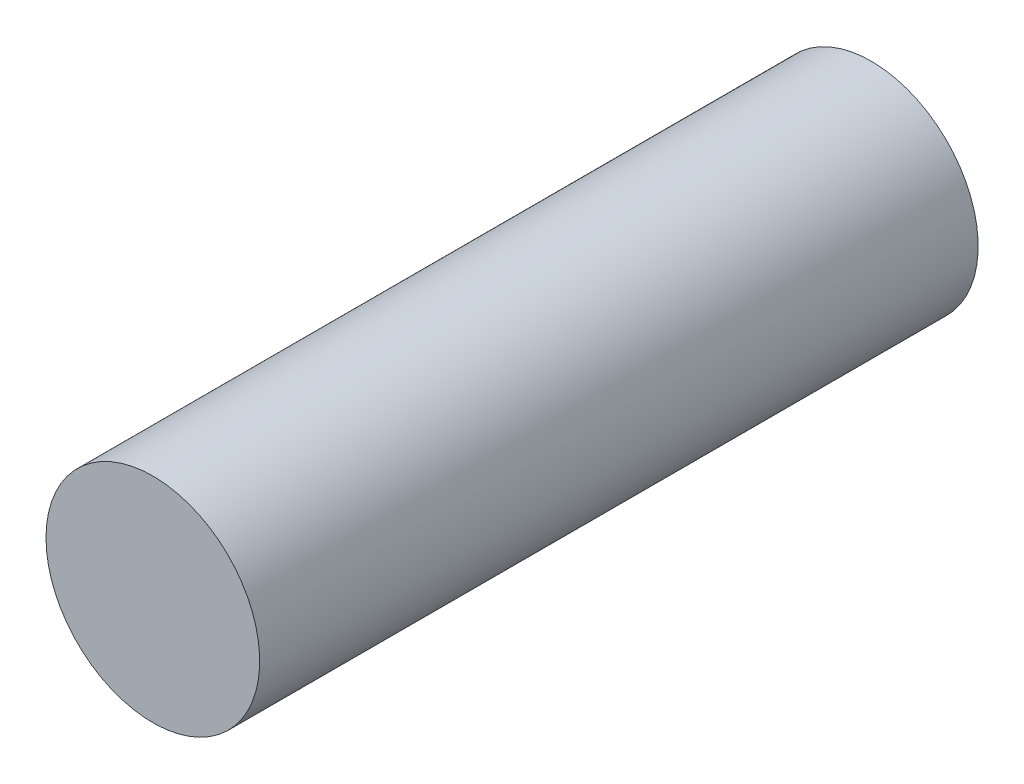
ISO-10303-21;
HEADER;
FILE_DESCRIPTION(('STEP AP214'),'2;1');
FILE_NAME('part.step','',(''),(''),'','','');
FILE_SCHEMA(('AUTOMOTIVE_DESIGN { 1 0 10303 214 1 1 1 1 }'));
ENDSEC;
DATA;
#1=APPLICATION_CONTEXT('core data for automotive mechanical design processes');
#2=APPLICATION_PROTOCOL_DEFINITION('international standard','automotive_design',2000,#1);
#3=PRODUCT_CONTEXT('',#1,'mechanical');
#4=PRODUCT('Part','Part','',(#3));
#5=PRODUCT_RELATED_PRODUCT_CATEGORY('part','',(#4));
#6=PRODUCT_DEFINITION_FORMATION('','',#4);
#7=PRODUCT_DEFINITION_CONTEXT('part definition',#1,'design');
#8=PRODUCT_DEFINITION('design','',#6,#7);
#9=PRODUCT_DEFINITION_SHAPE('','',#8);
#10=(LENGTH_UNIT() NAMED_UNIT(*) SI_UNIT(.MILLI.,.METRE.));
#11=(NAMED_UNIT(*) PLANE_ANGLE_UNIT() SI_UNIT($,.RADIAN.));
#12=(NAMED_UNIT(*) SI_UNIT($,.STERADIAN.) SOLID_ANGLE_UNIT());
#13=UNCERTAINTY_MEASURE_WITH_UNIT(LENGTH_MEASURE(1.E-05),#10,'distance_accuracy_value','');
#14=(GEOMETRIC_REPRESENTATION_CONTEXT(3) GLOBAL_UNCERTAINTY_ASSIGNED_CONTEXT((#13)) GLOBAL_UNIT_ASSIGNED_CONTEXT((#10,
#11,#12)) REPRESENTATION_CONTEXT('',''));
#15=CARTESIAN_POINT('',(0.,0.,0.));
#16=DIRECTION('',(0.,0.,1.));
#17=DIRECTION('',(1.,0.,0.));
#18=AXIS2_PLACEMENT_3D('',#15,#16,#17);
#19=CARTESIAN_POINT('',(0.3999992,0.,0.));
#20=DIRECTION('',(0.,0.,-1.));
#21=DIRECTION('',(-1.,0.,0.));
#22=AXIS2_PLACEMENT_3D('',#19,#20,#21);
#23=PLANE('',#22);
#24=CARTESIAN_POINT('',(0.,0.,0.));
#25=DIRECTION('',(0.,0.,-1.));
#26=DIRECTION('',(-1.,0.,0.));
#27=AXIS2_PLACEMENT_3D('',#24,#25,#26);
#28=CIRCLE('',#27,0.3999992);
#29=CARTESIAN_POINT('',(-0.3999992,0.,0.));
#30=VERTEX_POINT('',#29);
#31=EDGE_CURVE('E18',#30,#30,#28,.F.);
#32=ORIENTED_EDGE('',*,*,#31,.F.);
#33=EDGE_LOOP('',(#32));
#34=FACE_BOUND('',#33,.T.);
#35=ADVANCED_FACE('F15',(#34),#23,.T.);
#36=CARTESIAN_POINT('',(0.3999992,0.,2.6899997));
#37=DIRECTION('',(0.,0.,-1.));
#38=DIRECTION('',(-1.,0.,0.));
#39=AXIS2_PLACEMENT_3D('',#36,#37,#38);
#40=PLANE('',#39);
#41=CARTESIAN_POINT('',(0.,0.,2.6899997));
#42=DIRECTION('',(0.,0.,-1.));
#43=DIRECTION('',(-1.,0.,0.));
#44=AXIS2_PLACEMENT_3D('',#41,#42,#43);
#45=CIRCLE('',#44,0.3999992);
#46=CARTESIAN_POINT('',(-0.3999992,0.,2.6899997));
#47=VERTEX_POINT('',#46);
#48=EDGE_CURVE('E10',#47,#47,#45,.T.);
#49=ORIENTED_EDGE('',*,*,#48,.F.);
#50=EDGE_LOOP('',(#49));
#51=FACE_BOUND('',#50,.T.);
#52=ADVANCED_FACE('F30',(#51),#40,.F.);
#53=CARTESIAN_POINT('',(0.,0.,0.));
#54=DIRECTION('',(0.,0.,-1.));
#55=DIRECTION('',(-1.,0.,0.));
#56=AXIS2_PLACEMENT_3D('',#53,#54,#55);
#57=CYLINDRICAL_SURFACE('',#56,0.3999992);
#58=ORIENTED_EDGE('',*,*,#48,.T.);
#59=EDGE_LOOP('',(#58));
#60=FACE_BOUND('',#59,.T.);
#61=ORIENTED_EDGE('',*,*,#31,.T.);
#62=EDGE_LOOP('',(#61));
#63=FACE_BOUND('',#62,.T.);
#64=ADVANCED_FACE('F27',(#60,#63),#57,.T.);
#65=CLOSED_SHELL('',(#35,#52,#64));
#66=MANIFOLD_SOLID_BREP('B1',#65);
#67=ADVANCED_BREP_SHAPE_REPRESENTATION('',(#18,#66),#14);
#68=SHAPE_DEFINITION_REPRESENTATION(#9,#67);
ENDSEC;
END-ISO-10303-21;
